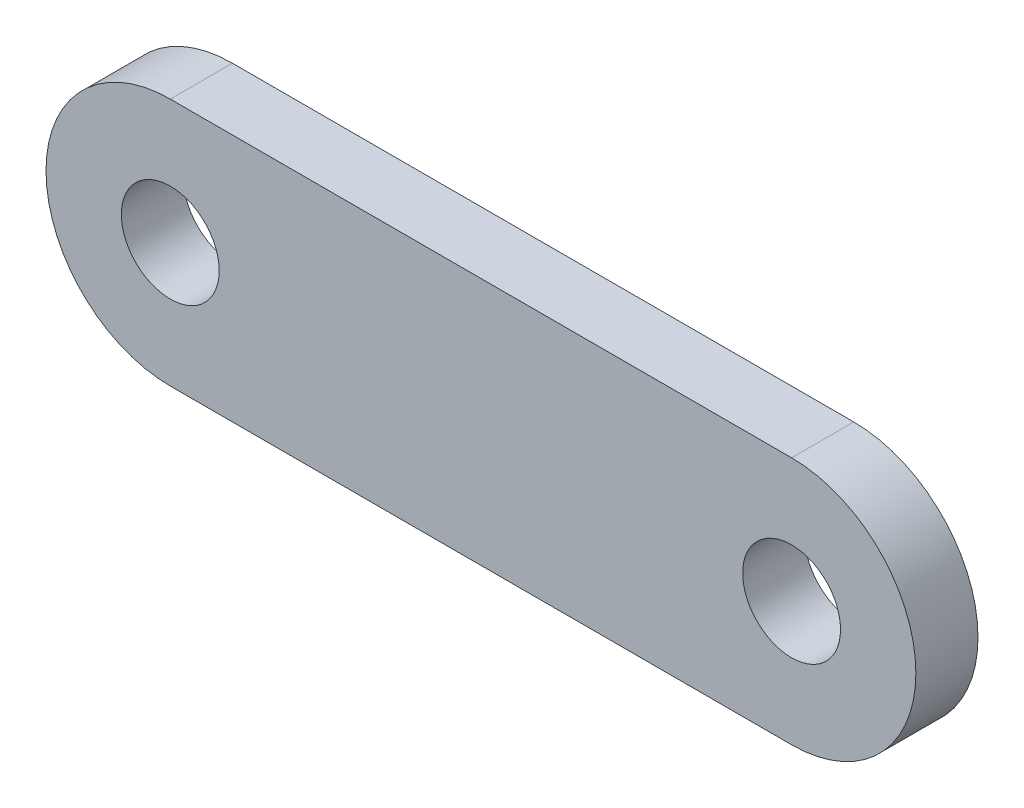
ISO-10303-21;
HEADER;
FILE_DESCRIPTION(('STEP AP214'),'2;1');
FILE_NAME('part.step','',(''),(''),'','','');
FILE_SCHEMA(('AUTOMOTIVE_DESIGN { 1 0 10303 214 1 1 1 1 }'));
ENDSEC;
DATA;
#1=APPLICATION_CONTEXT('core data for automotive mechanical design processes');
#2=APPLICATION_PROTOCOL_DEFINITION('international standard','automotive_design',2000,#1);
#3=PRODUCT_CONTEXT('',#1,'mechanical');
#4=PRODUCT('Part','Part','',(#3));
#5=PRODUCT_RELATED_PRODUCT_CATEGORY('part','',(#4));
#6=PRODUCT_DEFINITION_FORMATION('','',#4);
#7=PRODUCT_DEFINITION_CONTEXT('part definition',#1,'design');
#8=PRODUCT_DEFINITION('design','',#6,#7);
#9=PRODUCT_DEFINITION_SHAPE('','',#8);
#10=(LENGTH_UNIT() NAMED_UNIT(*) SI_UNIT(.MILLI.,.METRE.));
#11=(NAMED_UNIT(*) PLANE_ANGLE_UNIT() SI_UNIT($,.RADIAN.));
#12=(NAMED_UNIT(*) SI_UNIT($,.STERADIAN.) SOLID_ANGLE_UNIT());
#13=UNCERTAINTY_MEASURE_WITH_UNIT(LENGTH_MEASURE(1.E-05),#10,'distance_accuracy_value','');
#14=(GEOMETRIC_REPRESENTATION_CONTEXT(3) GLOBAL_UNCERTAINTY_ASSIGNED_CONTEXT((#13)) GLOBAL_UNIT_ASSIGNED_CONTEXT((#10,
#11,#12)) REPRESENTATION_CONTEXT('',''));
#15=CARTESIAN_POINT('',(0.,0.,0.));
#16=DIRECTION('',(0.,0.,1.));
#17=DIRECTION('',(1.,0.,0.));
#18=AXIS2_PLACEMENT_3D('',#15,#16,#17);
#19=CARTESIAN_POINT('',(0.,-4.,2.));
#20=DIRECTION('',(0.,1.,0.));
#21=DIRECTION('',(0.,0.,1.));
#22=AXIS2_PLACEMENT_3D('',#19,#20,#21);
#23=PLANE('',#22);
#24=DIRECTION('',(1.,0.,0.));
#25=VECTOR('',#24,1.);
#26=CARTESIAN_POINT('',(0.,-4.,0.));
#27=LINE('',#26,#25);
#28=CARTESIAN_POINT('',(0.,-4.,0.));
#29=VERTEX_POINT('',#28);
#30=CARTESIAN_POINT('',(20.,-4.,0.));
#31=VERTEX_POINT('',#30);
#32=EDGE_CURVE('E117',#29,#31,#27,.T.);
#33=ORIENTED_EDGE('',*,*,#32,.T.);
#34=DIRECTION('',(0.,0.,-1.));
#35=VECTOR('',#34,1.);
#36=CARTESIAN_POINT('',(20.,-4.,2.));
#37=LINE('',#36,#35);
#38=CARTESIAN_POINT('',(20.,-4.,2.));
#39=VERTEX_POINT('',#38);
#40=EDGE_CURVE('E11',#39,#31,#37,.T.);
#41=ORIENTED_EDGE('',*,*,#40,.F.);
#42=DIRECTION('',(1.,0.,0.));
#43=VECTOR('',#42,1.);
#44=CARTESIAN_POINT('',(0.,-4.,2.));
#45=LINE('',#44,#43);
#46=CARTESIAN_POINT('',(0.,-4.,2.));
#47=VERTEX_POINT('',#46);
#48=EDGE_CURVE('E90',#47,#39,#45,.T.);
#49=ORIENTED_EDGE('',*,*,#48,.F.);
#50=DIRECTION('',(0.,0.,-1.));
#51=VECTOR('',#50,1.);
#52=CARTESIAN_POINT('',(0.,-4.,2.));
#53=LINE('',#52,#51);
#54=EDGE_CURVE('E105',#47,#29,#53,.T.);
#55=ORIENTED_EDGE('',*,*,#54,.T.);
#56=EDGE_LOOP('',(#33,#41,#49,#55));
#57=FACE_BOUND('',#56,.T.);
#58=ADVANCED_FACE('F41',(#57),#23,.F.);
#59=CARTESIAN_POINT('',(20.,0.,2.));
#60=DIRECTION('',(0.,0.,-1.));
#61=DIRECTION('',(-1.,0.,0.));
#62=AXIS2_PLACEMENT_3D('',#59,#60,#61);
#63=CYLINDRICAL_SURFACE('',#62,4.);
#64=CARTESIAN_POINT('',(20.,0.,0.));
#65=DIRECTION('',(0.,0.,1.));
#66=DIRECTION('',(1.,0.,0.));
#67=AXIS2_PLACEMENT_3D('',#64,#65,#66);
#68=CIRCLE('',#67,4.);
#69=CARTESIAN_POINT('',(20.,4.,0.));
#70=VERTEX_POINT('',#69);
#71=EDGE_CURVE('E96',#31,#70,#68,.T.);
#72=ORIENTED_EDGE('',*,*,#71,.T.);
#73=DIRECTION('',(0.,0.,-1.));
#74=VECTOR('',#73,1.);
#75=CARTESIAN_POINT('',(20.,4.,2.));
#76=LINE('',#75,#74);
#77=CARTESIAN_POINT('',(20.,4.,2.));
#78=VERTEX_POINT('',#77);
#79=EDGE_CURVE('E51',#78,#70,#76,.T.);
#80=ORIENTED_EDGE('',*,*,#79,.F.);
#81=CARTESIAN_POINT('',(20.,0.,2.));
#82=DIRECTION('',(0.,0.,1.));
#83=DIRECTION('',(1.,0.,0.));
#84=AXIS2_PLACEMENT_3D('',#81,#82,#83);
#85=CIRCLE('',#84,4.);
#86=EDGE_CURVE('E85',#39,#78,#85,.T.);
#87=ORIENTED_EDGE('',*,*,#86,.F.);
#88=ORIENTED_EDGE('',*,*,#40,.T.);
#89=EDGE_LOOP('',(#72,#80,#87,#88));
#90=FACE_BOUND('',#89,.T.);
#91=ADVANCED_FACE('F95',(#90),#63,.T.);
#92=CARTESIAN_POINT('',(0.,4.,2.));
#93=DIRECTION('',(0.,1.,0.));
#94=DIRECTION('',(0.,0.,1.));
#95=AXIS2_PLACEMENT_3D('',#92,#93,#94);
#96=PLANE('',#95);
#97=DIRECTION('',(1.,0.,0.));
#98=VECTOR('',#97,1.);
#99=CARTESIAN_POINT('',(0.,4.,0.));
#100=LINE('',#99,#98);
#101=CARTESIAN_POINT('',(0.,4.,0.));
#102=VERTEX_POINT('',#101);
#103=EDGE_CURVE('E123',#102,#70,#100,.T.);
#104=ORIENTED_EDGE('',*,*,#103,.F.);
#105=DIRECTION('',(0.,0.,-1.));
#106=VECTOR('',#105,1.);
#107=CARTESIAN_POINT('',(0.,4.,2.));
#108=LINE('',#107,#106);
#109=CARTESIAN_POINT('',(0.,4.,2.));
#110=VERTEX_POINT('',#109);
#111=EDGE_CURVE('E75',#110,#102,#108,.T.);
#112=ORIENTED_EDGE('',*,*,#111,.F.);
#113=DIRECTION('',(1.,0.,0.));
#114=VECTOR('',#113,1.);
#115=CARTESIAN_POINT('',(0.,4.,2.));
#116=LINE('',#115,#114);
#117=EDGE_CURVE('E88',#110,#78,#116,.T.);
#118=ORIENTED_EDGE('',*,*,#117,.T.);
#119=ORIENTED_EDGE('',*,*,#79,.T.);
#120=EDGE_LOOP('',(#104,#112,#118,#119));
#121=FACE_BOUND('',#120,.T.);
#122=ADVANCED_FACE('F101',(#121),#96,.T.);
#123=CARTESIAN_POINT('',(0.,0.,2.));
#124=DIRECTION('',(0.,0.,-1.));
#125=DIRECTION('',(-1.,0.,0.));
#126=AXIS2_PLACEMENT_3D('',#123,#124,#125);
#127=CYLINDRICAL_SURFACE('',#126,1.575);
#128=CARTESIAN_POINT('',(0.,0.,2.));
#129=DIRECTION('',(0.,0.,1.));
#130=DIRECTION('',(1.,0.,0.));
#131=AXIS2_PLACEMENT_3D('',#128,#129,#130);
#132=CIRCLE('',#131,1.575);
#133=CARTESIAN_POINT('',(1.575,0.,2.));
#134=VERTEX_POINT('',#133);
#135=EDGE_CURVE('E165',#134,#134,#132,.T.);
#136=ORIENTED_EDGE('',*,*,#135,.T.);
#137=EDGE_LOOP('',(#136));
#138=FACE_BOUND('',#137,.T.);
#139=CARTESIAN_POINT('',(0.,0.,0.));
#140=DIRECTION('',(0.,0.,1.));
#141=DIRECTION('',(1.,0.,0.));
#142=AXIS2_PLACEMENT_3D('',#139,#140,#141);
#143=CIRCLE('',#142,1.575);
#144=CARTESIAN_POINT('',(1.575,0.,0.));
#145=VERTEX_POINT('',#144);
#146=EDGE_CURVE('E113',#145,#145,#143,.T.);
#147=ORIENTED_EDGE('',*,*,#146,.F.);
#148=EDGE_LOOP('',(#147));
#149=FACE_BOUND('',#148,.T.);
#150=ADVANCED_FACE('F154',(#138,#149),#127,.F.);
#151=CARTESIAN_POINT('',(20.,0.,2.));
#152=DIRECTION('',(0.,0.,-1.));
#153=DIRECTION('',(-1.,0.,0.));
#154=AXIS2_PLACEMENT_3D('',#151,#152,#153);
#155=CYLINDRICAL_SURFACE('',#154,1.575);
#156=CARTESIAN_POINT('',(20.,0.,2.));
#157=DIRECTION('',(0.,0.,1.));
#158=DIRECTION('',(1.,0.,0.));
#159=AXIS2_PLACEMENT_3D('',#156,#157,#158);
#160=CIRCLE('',#159,1.575);
#161=CARTESIAN_POINT('',(21.575,0.,2.));
#162=VERTEX_POINT('',#161);
#163=EDGE_CURVE('E128',#162,#162,#160,.T.);
#164=ORIENTED_EDGE('',*,*,#163,.T.);
#165=EDGE_LOOP('',(#164));
#166=FACE_BOUND('',#165,.T.);
#167=CARTESIAN_POINT('',(20.,0.,0.));
#168=DIRECTION('',(0.,0.,1.));
#169=DIRECTION('',(1.,0.,0.));
#170=AXIS2_PLACEMENT_3D('',#167,#168,#169);
#171=CIRCLE('',#170,1.575);
#172=CARTESIAN_POINT('',(21.575,0.,0.));
#173=VERTEX_POINT('',#172);
#174=EDGE_CURVE('E109',#173,#173,#171,.T.);
#175=ORIENTED_EDGE('',*,*,#174,.F.);
#176=EDGE_LOOP('',(#175));
#177=FACE_BOUND('',#176,.T.);
#178=ADVANCED_FACE('F43',(#166,#177),#155,.F.);
#179=CARTESIAN_POINT('',(0.,0.,2.));
#180=DIRECTION('',(0.,0.,-1.));
#181=DIRECTION('',(-1.,0.,0.));
#182=AXIS2_PLACEMENT_3D('',#179,#180,#181);
#183=CYLINDRICAL_SURFACE('',#182,4.);
#184=CARTESIAN_POINT('',(0.,0.,0.));
#185=DIRECTION('',(0.,0.,1.));
#186=DIRECTION('',(1.,0.,0.));
#187=AXIS2_PLACEMENT_3D('',#184,#185,#186);
#188=CIRCLE('',#187,4.);
#189=EDGE_CURVE('E78',#102,#29,#188,.T.);
#190=ORIENTED_EDGE('',*,*,#189,.T.);
#191=ORIENTED_EDGE('',*,*,#54,.F.);
#192=CARTESIAN_POINT('',(0.,0.,2.));
#193=DIRECTION('',(0.,0.,1.));
#194=DIRECTION('',(1.,0.,0.));
#195=AXIS2_PLACEMENT_3D('',#192,#193,#194);
#196=CIRCLE('',#195,4.);
#197=EDGE_CURVE('E59',#110,#47,#196,.T.);
#198=ORIENTED_EDGE('',*,*,#197,.F.);
#199=ORIENTED_EDGE('',*,*,#111,.T.);
#200=EDGE_LOOP('',(#190,#191,#198,#199));
#201=FACE_BOUND('',#200,.T.);
#202=ADVANCED_FACE('F142',(#201),#183,.T.);
#203=CARTESIAN_POINT('',(0.,0.,2.));
#204=DIRECTION('',(0.,0.,1.));
#205=DIRECTION('',(1.,0.,0.));
#206=AXIS2_PLACEMENT_3D('',#203,#204,#205);
#207=PLANE('',#206);
#208=ORIENTED_EDGE('',*,*,#163,.F.);
#209=EDGE_LOOP('',(#208));
#210=FACE_BOUND('',#209,.T.);
#211=ORIENTED_EDGE('',*,*,#135,.F.);
#212=EDGE_LOOP('',(#211));
#213=FACE_BOUND('',#212,.T.);
#214=ORIENTED_EDGE('',*,*,#48,.T.);
#215=ORIENTED_EDGE('',*,*,#86,.T.);
#216=ORIENTED_EDGE('',*,*,#117,.F.);
#217=ORIENTED_EDGE('',*,*,#197,.T.);
#218=EDGE_LOOP('',(#214,#215,#216,#217));
#219=FACE_BOUND('',#218,.T.);
#220=ADVANCED_FACE('F86',(#210,#213,#219),#207,.T.);
#221=CARTESIAN_POINT('',(0.,0.,0.));
#222=DIRECTION('',(0.,0.,1.));
#223=DIRECTION('',(1.,0.,0.));
#224=AXIS2_PLACEMENT_3D('',#221,#222,#223);
#225=PLANE('',#224);
#226=ORIENTED_EDGE('',*,*,#174,.T.);
#227=EDGE_LOOP('',(#226));
#228=FACE_BOUND('',#227,.T.);
#229=ORIENTED_EDGE('',*,*,#146,.T.);
#230=EDGE_LOOP('',(#229));
#231=FACE_BOUND('',#230,.T.);
#232=ORIENTED_EDGE('',*,*,#32,.F.);
#233=ORIENTED_EDGE('',*,*,#189,.F.);
#234=ORIENTED_EDGE('',*,*,#103,.T.);
#235=ORIENTED_EDGE('',*,*,#71,.F.);
#236=EDGE_LOOP('',(#232,#233,#234,#235));
#237=FACE_BOUND('',#236,.T.);
#238=ADVANCED_FACE('F135',(#228,#231,#237),#225,.F.);
#239=CLOSED_SHELL('',(#58,#91,#122,#150,#178,#202,#220,#238));
#240=MANIFOLD_SOLID_BREP('B2',#239);
#241=ADVANCED_BREP_SHAPE_REPRESENTATION('',(#18,#240),#14);
#242=SHAPE_DEFINITION_REPRESENTATION(#9,#241);
ENDSEC;
END-ISO-10303-21;
